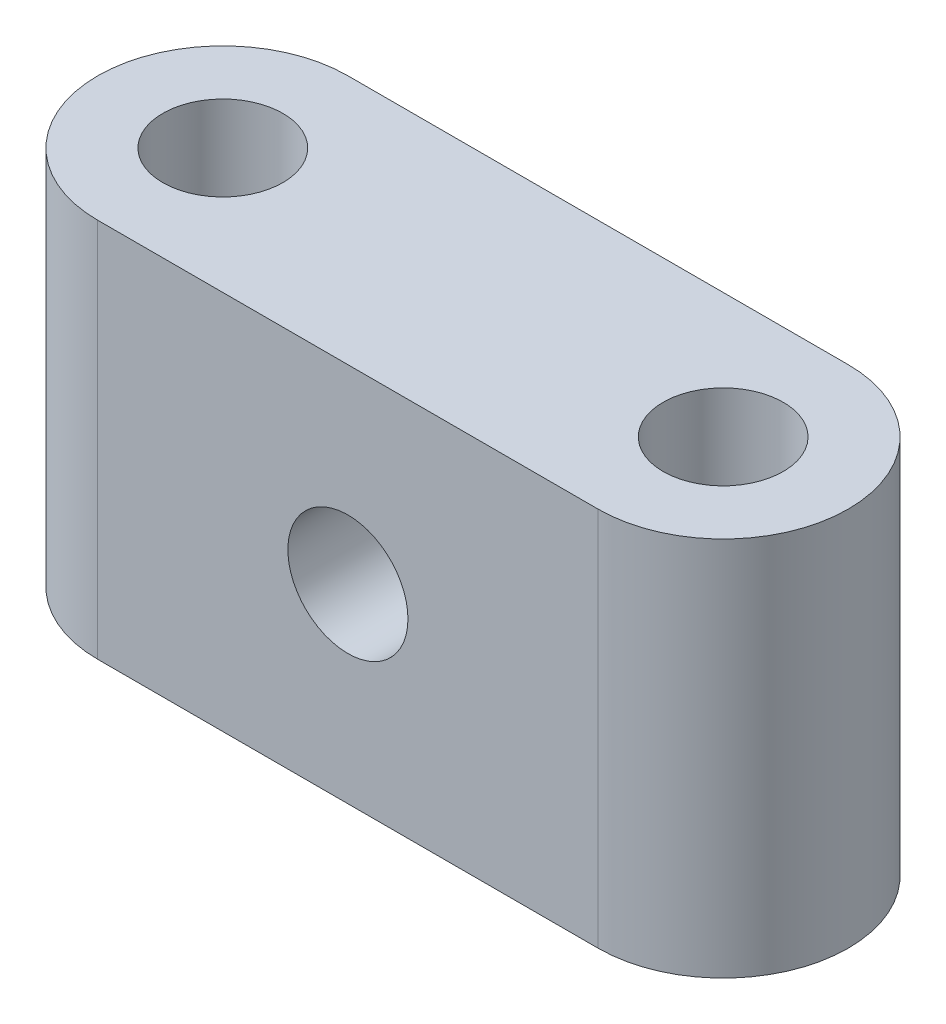
ISO-10303-21;
HEADER;
FILE_DESCRIPTION(('STEP AP214'),'2;1');
FILE_NAME('part.step','',(''),(''),'','','');
FILE_SCHEMA(('AUTOMOTIVE_DESIGN { 1 0 10303 214 1 1 1 1 }'));
ENDSEC;
DATA;
#1=APPLICATION_CONTEXT('core data for automotive mechanical design processes');
#2=APPLICATION_PROTOCOL_DEFINITION('international standard','automotive_design',2000,#1);
#3=PRODUCT_CONTEXT('',#1,'mechanical');
#4=PRODUCT('Part','Part','',(#3));
#5=PRODUCT_RELATED_PRODUCT_CATEGORY('part','',(#4));
#6=PRODUCT_DEFINITION_FORMATION('','',#4);
#7=PRODUCT_DEFINITION_CONTEXT('part definition',#1,'design');
#8=PRODUCT_DEFINITION('design','',#6,#7);
#9=PRODUCT_DEFINITION_SHAPE('','',#8);
#10=(LENGTH_UNIT() NAMED_UNIT(*) SI_UNIT(.MILLI.,.METRE.));
#11=(NAMED_UNIT(*) PLANE_ANGLE_UNIT() SI_UNIT($,.RADIAN.));
#12=(NAMED_UNIT(*) SI_UNIT($,.STERADIAN.) SOLID_ANGLE_UNIT());
#13=UNCERTAINTY_MEASURE_WITH_UNIT(LENGTH_MEASURE(1.E-05),#10,'distance_accuracy_value','');
#14=(GEOMETRIC_REPRESENTATION_CONTEXT(3) GLOBAL_UNCERTAINTY_ASSIGNED_CONTEXT((#13)) GLOBAL_UNIT_ASSIGNED_CONTEXT((#10,
#11,#12)) REPRESENTATION_CONTEXT('',''));
#15=CARTESIAN_POINT('',(0.,0.,0.));
#16=DIRECTION('',(0.,0.,1.));
#17=DIRECTION('',(1.,0.,0.));
#18=AXIS2_PLACEMENT_3D('',#15,#16,#17);
#19=CARTESIAN_POINT('',(0.,38.,0.));
#20=DIRECTION('',(0.,1.,0.));
#21=DIRECTION('',(0.,0.,1.));
#22=AXIS2_PLACEMENT_3D('',#19,#20,#21);
#23=PLANE('',#22);
#24=CARTESIAN_POINT('',(0.,38.,0.));
#25=DIRECTION('',(0.,1.,0.));
#26=DIRECTION('',(0.,0.,1.));
#27=AXIS2_PLACEMENT_3D('',#24,#25,#26);
#28=CIRCLE('',#27,6.);
#29=CARTESIAN_POINT('',(0.,38.,6.));
#30=VERTEX_POINT('',#29);
#31=EDGE_CURVE('E102',#30,#30,#28,.T.);
#32=ORIENTED_EDGE('',*,*,#31,.F.);
#33=EDGE_LOOP('',(#32));
#34=FACE_BOUND('',#33,.T.);
#35=CARTESIAN_POINT('',(0.,38.,0.));
#36=DIRECTION('',(0.,1.,0.));
#37=DIRECTION('',(0.,0.,1.));
#38=AXIS2_PLACEMENT_3D('',#35,#36,#37);
#39=CIRCLE('',#38,12.5);
#40=CARTESIAN_POINT('',(0.,38.,-12.5));
#41=VERTEX_POINT('',#40);
#42=CARTESIAN_POINT('',(0.,38.,12.5));
#43=VERTEX_POINT('',#42);
#44=EDGE_CURVE('E86',#41,#43,#39,.T.);
#45=ORIENTED_EDGE('',*,*,#44,.T.);
#46=DIRECTION('',(1.,0.,0.));
#47=VECTOR('',#46,1.);
#48=CARTESIAN_POINT('',(0.,38.,12.5));
#49=LINE('',#48,#47);
#50=CARTESIAN_POINT('',(50.,38.,12.5));
#51=VERTEX_POINT('',#50);
#52=EDGE_CURVE('E81',#43,#51,#49,.T.);
#53=ORIENTED_EDGE('',*,*,#52,.T.);
#54=CARTESIAN_POINT('',(50.,38.,0.));
#55=DIRECTION('',(0.,1.,0.));
#56=DIRECTION('',(0.,0.,1.));
#57=AXIS2_PLACEMENT_3D('',#54,#55,#56);
#58=CIRCLE('',#57,12.5);
#59=CARTESIAN_POINT('',(50.,38.,-12.5));
#60=VERTEX_POINT('',#59);
#61=EDGE_CURVE('E84',#51,#60,#58,.T.);
#62=ORIENTED_EDGE('',*,*,#61,.T.);
#63=DIRECTION('',(-1.,0.,0.));
#64=VECTOR('',#63,1.);
#65=CARTESIAN_POINT('',(0.,38.,-12.5));
#66=LINE('',#65,#64);
#67=EDGE_CURVE('E51',#60,#41,#66,.T.);
#68=ORIENTED_EDGE('',*,*,#67,.T.);
#69=EDGE_LOOP('',(#45,#53,#62,#68));
#70=FACE_BOUND('',#69,.T.);
#71=CARTESIAN_POINT('',(50.,38.,0.));
#72=DIRECTION('',(0.,1.,0.));
#73=DIRECTION('',(0.,0.,1.));
#74=AXIS2_PLACEMENT_3D('',#71,#72,#73);
#75=CIRCLE('',#74,5.99999999999999);
#76=CARTESIAN_POINT('',(50.,38.,5.99999999999999));
#77=VERTEX_POINT('',#76);
#78=EDGE_CURVE('E117',#77,#77,#75,.T.);
#79=ORIENTED_EDGE('',*,*,#78,.F.);
#80=EDGE_LOOP('',(#79));
#81=FACE_BOUND('',#80,.T.);
#82=ADVANCED_FACE('F33',(#34,#70,#81),#23,.T.);
#83=CARTESIAN_POINT('',(0.,0.,0.));
#84=DIRECTION('',(0.,1.,0.));
#85=DIRECTION('',(0.,0.,1.));
#86=AXIS2_PLACEMENT_3D('',#83,#84,#85);
#87=PLANE('',#86);
#88=CARTESIAN_POINT('',(0.,0.,0.));
#89=DIRECTION('',(0.,1.,0.));
#90=DIRECTION('',(0.,0.,1.));
#91=AXIS2_PLACEMENT_3D('',#88,#89,#90);
#92=CIRCLE('',#91,6.);
#93=CARTESIAN_POINT('',(0.,0.,6.));
#94=VERTEX_POINT('',#93);
#95=EDGE_CURVE('E114',#94,#94,#92,.T.);
#96=ORIENTED_EDGE('',*,*,#95,.T.);
#97=EDGE_LOOP('',(#96));
#98=FACE_BOUND('',#97,.T.);
#99=CARTESIAN_POINT('',(0.,0.,0.));
#100=DIRECTION('',(0.,1.,0.));
#101=DIRECTION('',(0.,0.,1.));
#102=AXIS2_PLACEMENT_3D('',#99,#100,#101);
#103=CIRCLE('',#102,12.5);
#104=CARTESIAN_POINT('',(0.,0.,-12.5));
#105=VERTEX_POINT('',#104);
#106=CARTESIAN_POINT('',(0.,0.,12.5));
#107=VERTEX_POINT('',#106);
#108=EDGE_CURVE('E99',#105,#107,#103,.T.);
#109=ORIENTED_EDGE('',*,*,#108,.F.);
#110=DIRECTION('',(-1.,0.,0.));
#111=VECTOR('',#110,1.);
#112=CARTESIAN_POINT('',(0.,0.,-12.5));
#113=LINE('',#112,#111);
#114=CARTESIAN_POINT('',(50.,0.,-12.5));
#115=VERTEX_POINT('',#114);
#116=EDGE_CURVE('E74',#115,#105,#113,.T.);
#117=ORIENTED_EDGE('',*,*,#116,.F.);
#118=CARTESIAN_POINT('',(50.,0.,0.));
#119=DIRECTION('',(0.,1.,0.));
#120=DIRECTION('',(0.,0.,1.));
#121=AXIS2_PLACEMENT_3D('',#118,#119,#120);
#122=CIRCLE('',#121,12.5);
#123=CARTESIAN_POINT('',(50.,0.,12.5));
#124=VERTEX_POINT('',#123);
#125=EDGE_CURVE('E68',#124,#115,#122,.T.);
#126=ORIENTED_EDGE('',*,*,#125,.F.);
#127=DIRECTION('',(1.,0.,0.));
#128=VECTOR('',#127,1.);
#129=CARTESIAN_POINT('',(0.,0.,12.5));
#130=LINE('',#129,#128);
#131=EDGE_CURVE('E90',#107,#124,#130,.T.);
#132=ORIENTED_EDGE('',*,*,#131,.F.);
#133=EDGE_LOOP('',(#109,#117,#126,#132));
#134=FACE_BOUND('',#133,.T.);
#135=CARTESIAN_POINT('',(50.,0.,0.));
#136=DIRECTION('',(0.,1.,0.));
#137=DIRECTION('',(0.,0.,1.));
#138=AXIS2_PLACEMENT_3D('',#135,#136,#137);
#139=CIRCLE('',#138,5.99999999999999);
#140=CARTESIAN_POINT('',(50.,0.,5.99999999999999));
#141=VERTEX_POINT('',#140);
#142=EDGE_CURVE('E120',#141,#141,#139,.T.);
#143=ORIENTED_EDGE('',*,*,#142,.T.);
#144=EDGE_LOOP('',(#143));
#145=FACE_BOUND('',#144,.T.);
#146=ADVANCED_FACE('F110',(#98,#134,#145),#87,.F.);
#147=CARTESIAN_POINT('',(0.,38.,0.));
#148=DIRECTION('',(0.,-1.,0.));
#149=DIRECTION('',(0.,0.,-1.));
#150=AXIS2_PLACEMENT_3D('',#147,#148,#149);
#151=CYLINDRICAL_SURFACE('',#150,12.5);
#152=ORIENTED_EDGE('',*,*,#108,.T.);
#153=DIRECTION('',(0.,-1.,0.));
#154=VECTOR('',#153,1.);
#155=CARTESIAN_POINT('',(0.,38.,12.5));
#156=LINE('',#155,#154);
#157=EDGE_CURVE('E11',#43,#107,#156,.T.);
#158=ORIENTED_EDGE('',*,*,#157,.F.);
#159=ORIENTED_EDGE('',*,*,#44,.F.);
#160=DIRECTION('',(0.,-1.,0.));
#161=VECTOR('',#160,1.);
#162=CARTESIAN_POINT('',(0.,38.,-12.5));
#163=LINE('',#162,#161);
#164=EDGE_CURVE('E95',#41,#105,#163,.T.);
#165=ORIENTED_EDGE('',*,*,#164,.T.);
#166=EDGE_LOOP('',(#152,#158,#159,#165));
#167=FACE_BOUND('',#166,.T.);
#168=ADVANCED_FACE('F35',(#167),#151,.T.);
#169=CARTESIAN_POINT('',(0.,38.,12.5));
#170=DIRECTION('',(0.,0.,-1.));
#171=DIRECTION('',(-1.,0.,0.));
#172=AXIS2_PLACEMENT_3D('',#169,#170,#171);
#173=PLANE('',#172);
#174=CARTESIAN_POINT('',(25.,19.,12.5));
#175=DIRECTION('',(0.,0.,1.));
#176=DIRECTION('',(1.,0.,0.));
#177=AXIS2_PLACEMENT_3D('',#174,#175,#176);
#178=CIRCLE('',#177,6.);
#179=CARTESIAN_POINT('',(31.,19.,12.5));
#180=VERTEX_POINT('',#179);
#181=EDGE_CURVE('E125',#180,#180,#178,.T.);
#182=ORIENTED_EDGE('',*,*,#181,.F.);
#183=EDGE_LOOP('',(#182));
#184=FACE_BOUND('',#183,.T.);
#185=ORIENTED_EDGE('',*,*,#131,.T.);
#186=DIRECTION('',(0.,-1.,0.));
#187=VECTOR('',#186,1.);
#188=CARTESIAN_POINT('',(50.,38.,12.5));
#189=LINE('',#188,#187);
#190=EDGE_CURVE('E43',#51,#124,#189,.T.);
#191=ORIENTED_EDGE('',*,*,#190,.F.);
#192=ORIENTED_EDGE('',*,*,#52,.F.);
#193=ORIENTED_EDGE('',*,*,#157,.T.);
#194=EDGE_LOOP('',(#185,#191,#192,#193));
#195=FACE_BOUND('',#194,.T.);
#196=ADVANCED_FACE('F89',(#184,#195),#173,.F.);
#197=CARTESIAN_POINT('',(50.,38.,0.));
#198=DIRECTION('',(0.,-1.,0.));
#199=DIRECTION('',(0.,0.,-1.));
#200=AXIS2_PLACEMENT_3D('',#197,#198,#199);
#201=CYLINDRICAL_SURFACE('',#200,12.5);
#202=ORIENTED_EDGE('',*,*,#125,.T.);
#203=DIRECTION('',(0.,-1.,0.));
#204=VECTOR('',#203,1.);
#205=CARTESIAN_POINT('',(50.,38.,-12.5));
#206=LINE('',#205,#204);
#207=EDGE_CURVE('E91',#60,#115,#206,.T.);
#208=ORIENTED_EDGE('',*,*,#207,.F.);
#209=ORIENTED_EDGE('',*,*,#61,.F.);
#210=ORIENTED_EDGE('',*,*,#190,.T.);
#211=EDGE_LOOP('',(#202,#208,#209,#210));
#212=FACE_BOUND('',#211,.T.);
#213=ADVANCED_FACE('F93',(#212),#201,.T.);
#214=CARTESIAN_POINT('',(0.,38.,-12.5));
#215=DIRECTION('',(0.,0.,1.));
#216=DIRECTION('',(1.,0.,0.));
#217=AXIS2_PLACEMENT_3D('',#214,#215,#216);
#218=PLANE('',#217);
#219=CARTESIAN_POINT('',(25.,19.,-12.5));
#220=DIRECTION('',(0.,0.,1.));
#221=DIRECTION('',(1.,0.,0.));
#222=AXIS2_PLACEMENT_3D('',#219,#220,#221);
#223=CIRCLE('',#222,6.);
#224=CARTESIAN_POINT('',(31.,19.,-12.5));
#225=VERTEX_POINT('',#224);
#226=EDGE_CURVE('E37',#225,#225,#223,.T.);
#227=ORIENTED_EDGE('',*,*,#226,.T.);
#228=EDGE_LOOP('',(#227));
#229=FACE_BOUND('',#228,.T.);
#230=ORIENTED_EDGE('',*,*,#116,.T.);
#231=ORIENTED_EDGE('',*,*,#164,.F.);
#232=ORIENTED_EDGE('',*,*,#67,.F.);
#233=ORIENTED_EDGE('',*,*,#207,.T.);
#234=EDGE_LOOP('',(#230,#231,#232,#233));
#235=FACE_BOUND('',#234,.T.);
#236=ADVANCED_FACE('F107',(#229,#235),#218,.F.);
#237=CARTESIAN_POINT('',(0.,38.,0.));
#238=DIRECTION('',(0.,-1.,0.));
#239=DIRECTION('',(0.,0.,-1.));
#240=AXIS2_PLACEMENT_3D('',#237,#238,#239);
#241=CYLINDRICAL_SURFACE('',#240,6.);
#242=ORIENTED_EDGE('',*,*,#31,.T.);
#243=EDGE_LOOP('',(#242));
#244=FACE_BOUND('',#243,.T.);
#245=ORIENTED_EDGE('',*,*,#95,.F.);
#246=EDGE_LOOP('',(#245));
#247=FACE_BOUND('',#246,.T.);
#248=ADVANCED_FACE('F140',(#244,#247),#241,.F.);
#249=CARTESIAN_POINT('',(50.,38.,0.));
#250=DIRECTION('',(0.,-1.,0.));
#251=DIRECTION('',(0.,0.,-1.));
#252=AXIS2_PLACEMENT_3D('',#249,#250,#251);
#253=CYLINDRICAL_SURFACE('',#252,5.99999999999999);
#254=ORIENTED_EDGE('',*,*,#78,.T.);
#255=EDGE_LOOP('',(#254));
#256=FACE_BOUND('',#255,.T.);
#257=ORIENTED_EDGE('',*,*,#142,.F.);
#258=EDGE_LOOP('',(#257));
#259=FACE_BOUND('',#258,.T.);
#260=ADVANCED_FACE('F135',(#256,#259),#253,.F.);
#261=CARTESIAN_POINT('',(25.,19.,-25.5));
#262=DIRECTION('',(0.,0.,1.));
#263=DIRECTION('',(1.,0.,0.));
#264=AXIS2_PLACEMENT_3D('',#261,#262,#263);
#265=CYLINDRICAL_SURFACE('',#264,6.);
#266=ORIENTED_EDGE('',*,*,#181,.T.);
#267=EDGE_LOOP('',(#266));
#268=FACE_BOUND('',#267,.T.);
#269=ORIENTED_EDGE('',*,*,#226,.F.);
#270=EDGE_LOOP('',(#269));
#271=FACE_BOUND('',#270,.T.);
#272=ADVANCED_FACE('F133',(#268,#271),#265,.F.);
#273=CLOSED_SHELL('',(#82,#146,#168,#196,#213,#236,#248,#260,#272));
#274=MANIFOLD_SOLID_BREP('B2',#273);
#275=ADVANCED_BREP_SHAPE_REPRESENTATION('',(#18,#274),#14);
#276=SHAPE_DEFINITION_REPRESENTATION(#9,#275);
ENDSEC;
END-ISO-10303-21;
